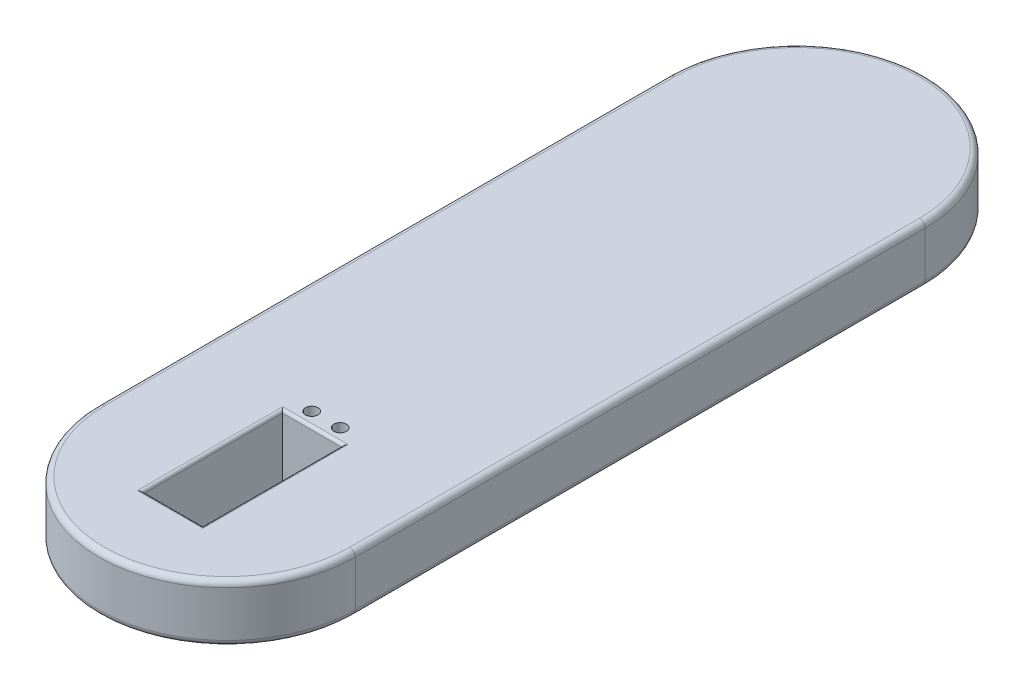
ISO-10303-21;
HEADER;
FILE_DESCRIPTION(('STEP AP214'),'2;1');
FILE_NAME('part.step','',(''),(''),'','','');
FILE_SCHEMA(('AUTOMOTIVE_DESIGN { 1 0 10303 214 1 1 1 1 }'));
ENDSEC;
DATA;
#1=APPLICATION_CONTEXT('core data for automotive mechanical design processes');
#2=APPLICATION_PROTOCOL_DEFINITION('international standard','automotive_design',2000,#1);
#3=PRODUCT_CONTEXT('',#1,'mechanical');
#4=PRODUCT('Part','Part','',(#3));
#5=PRODUCT_RELATED_PRODUCT_CATEGORY('part','',(#4));
#6=PRODUCT_DEFINITION_FORMATION('','',#4);
#7=PRODUCT_DEFINITION_CONTEXT('part definition',#1,'design');
#8=PRODUCT_DEFINITION('design','',#6,#7);
#9=PRODUCT_DEFINITION_SHAPE('','',#8);
#10=(LENGTH_UNIT() NAMED_UNIT(*) SI_UNIT(.MILLI.,.METRE.));
#11=(NAMED_UNIT(*) PLANE_ANGLE_UNIT() SI_UNIT($,.RADIAN.));
#12=(NAMED_UNIT(*) SI_UNIT($,.STERADIAN.) SOLID_ANGLE_UNIT());
#13=UNCERTAINTY_MEASURE_WITH_UNIT(LENGTH_MEASURE(1.E-05),#10,'distance_accuracy_value','');
#14=(GEOMETRIC_REPRESENTATION_CONTEXT(3) GLOBAL_UNCERTAINTY_ASSIGNED_CONTEXT((#13)) GLOBAL_UNIT_ASSIGNED_CONTEXT((#10,
#11,#12)) REPRESENTATION_CONTEXT('',''));
#15=CARTESIAN_POINT('',(0.,0.,0.));
#16=DIRECTION('',(0.,0.,1.));
#17=DIRECTION('',(1.,0.,0.));
#18=AXIS2_PLACEMENT_3D('',#15,#16,#17);
#19=CARTESIAN_POINT('',(-45.,-20.,0.));
#20=DIRECTION('',(0.,1.,0.));
#21=DIRECTION('',(0.,0.,1.));
#22=AXIS2_PLACEMENT_3D('',#19,#20,#21);
#23=CYLINDRICAL_SURFACE('',#22,45.);
#24=DIRECTION('',(0.,1.,0.));
#25=VECTOR('',#24,1.);
#26=CARTESIAN_POINT('',(-90.,-20.,0.));
#27=LINE('',#26,#25);
#28=CARTESIAN_POINT('',(-90.,-18.,0.));
#29=VERTEX_POINT('',#28);
#30=CARTESIAN_POINT('',(-90.,-2.,0.));
#31=VERTEX_POINT('',#30);
#32=EDGE_CURVE('E250',#29,#31,#27,.T.);
#33=ORIENTED_EDGE('',*,*,#32,.F.);
#34=CARTESIAN_POINT('',(-45.,-18.,0.));
#35=DIRECTION('',(0.,1.,0.));
#36=DIRECTION('',(0.,0.,1.));
#37=AXIS2_PLACEMENT_3D('',#34,#35,#36);
#38=CIRCLE('',#37,45.);
#39=CARTESIAN_POINT('',(0.,-18.,0.));
#40=VERTEX_POINT('',#39);
#41=EDGE_CURVE('E297',#29,#40,#38,.T.);
#42=ORIENTED_EDGE('',*,*,#41,.T.);
#43=DIRECTION('',(0.,1.,0.));
#44=VECTOR('',#43,1.);
#45=CARTESIAN_POINT('',(0.,-20.,0.));
#46=LINE('',#45,#44);
#47=CARTESIAN_POINT('',(0.,-2.,0.));
#48=VERTEX_POINT('',#47);
#49=EDGE_CURVE('E260',#40,#48,#46,.T.);
#50=ORIENTED_EDGE('',*,*,#49,.T.);
#51=CARTESIAN_POINT('',(-45.,-2.,0.));
#52=DIRECTION('',(0.,1.,0.));
#53=DIRECTION('',(0.,0.,1.));
#54=AXIS2_PLACEMENT_3D('',#51,#52,#53);
#55=CIRCLE('',#54,45.);
#56=EDGE_CURVE('E295',#48,#31,#55,.F.);
#57=ORIENTED_EDGE('',*,*,#56,.T.);
#58=EDGE_LOOP('',(#33,#42,#50,#57));
#59=FACE_BOUND('',#58,.T.);
#60=ADVANCED_FACE('F34',(#59),#23,.T.);
#61=CARTESIAN_POINT('',(-90.,-20.,0.));
#62=DIRECTION('',(-1.,0.,0.));
#63=DIRECTION('',(0.,0.,1.));
#64=AXIS2_PLACEMENT_3D('',#61,#62,#63);
#65=PLANE('',#64);
#66=DIRECTION('',(0.,1.,0.));
#67=VECTOR('',#66,1.);
#68=CARTESIAN_POINT('',(-90.,-20.,-200.));
#69=LINE('',#68,#67);
#70=CARTESIAN_POINT('',(-90.,-18.,-200.));
#71=VERTEX_POINT('',#70);
#72=CARTESIAN_POINT('',(-90.,-2.,-200.));
#73=VERTEX_POINT('',#72);
#74=EDGE_CURVE('E254',#71,#73,#69,.T.);
#75=ORIENTED_EDGE('',*,*,#74,.F.);
#76=DIRECTION('',(0.,0.,1.));
#77=VECTOR('',#76,1.);
#78=CARTESIAN_POINT('',(-90.,-18.,0.));
#79=LINE('',#78,#77);
#80=EDGE_CURVE('E289',#71,#29,#79,.T.);
#81=ORIENTED_EDGE('',*,*,#80,.T.);
#82=ORIENTED_EDGE('',*,*,#32,.T.);
#83=DIRECTION('',(0.,0.,1.));
#84=VECTOR('',#83,1.);
#85=CARTESIAN_POINT('',(-90.,-2.,0.));
#86=LINE('',#85,#84);
#87=EDGE_CURVE('E287',#31,#73,#86,.F.);
#88=ORIENTED_EDGE('',*,*,#87,.T.);
#89=EDGE_LOOP('',(#75,#81,#82,#88));
#90=FACE_BOUND('',#89,.T.);
#91=ADVANCED_FACE('F402',(#90),#65,.T.);
#92=CARTESIAN_POINT('',(-45.,-20.,-200.));
#93=DIRECTION('',(0.,1.,0.));
#94=DIRECTION('',(0.,0.,1.));
#95=AXIS2_PLACEMENT_3D('',#92,#93,#94);
#96=CYLINDRICAL_SURFACE('',#95,45.);
#97=DIRECTION('',(0.,1.,0.));
#98=VECTOR('',#97,1.);
#99=CARTESIAN_POINT('',(0.,-20.,-200.));
#100=LINE('',#99,#98);
#101=CARTESIAN_POINT('',(0.,-18.,-200.));
#102=VERTEX_POINT('',#101);
#103=CARTESIAN_POINT('',(0.,-2.,-200.));
#104=VERTEX_POINT('',#103);
#105=EDGE_CURVE('E257',#102,#104,#100,.T.);
#106=ORIENTED_EDGE('',*,*,#105,.F.);
#107=CARTESIAN_POINT('',(-45.,-18.,-200.));
#108=DIRECTION('',(0.,1.,0.));
#109=DIRECTION('',(0.,0.,1.));
#110=AXIS2_PLACEMENT_3D('',#107,#108,#109);
#111=CIRCLE('',#110,45.);
#112=EDGE_CURVE('E293',#102,#71,#111,.T.);
#113=ORIENTED_EDGE('',*,*,#112,.T.);
#114=ORIENTED_EDGE('',*,*,#74,.T.);
#115=CARTESIAN_POINT('',(-45.,-2.,-200.));
#116=DIRECTION('',(0.,1.,0.));
#117=DIRECTION('',(0.,0.,1.));
#118=AXIS2_PLACEMENT_3D('',#115,#116,#117);
#119=CIRCLE('',#118,45.);
#120=EDGE_CURVE('E291',#73,#104,#119,.F.);
#121=ORIENTED_EDGE('',*,*,#120,.T.);
#122=EDGE_LOOP('',(#106,#113,#114,#121));
#123=FACE_BOUND('',#122,.T.);
#124=ADVANCED_FACE('F408',(#123),#96,.T.);
#125=CARTESIAN_POINT('',(0.,-20.,0.));
#126=DIRECTION('',(1.,0.,0.));
#127=DIRECTION('',(0.,0.,-1.));
#128=AXIS2_PLACEMENT_3D('',#125,#126,#127);
#129=PLANE('',#128);
#130=ORIENTED_EDGE('',*,*,#49,.F.);
#131=DIRECTION('',(0.,0.,-1.));
#132=VECTOR('',#131,1.);
#133=CARTESIAN_POINT('',(0.,-18.,-200.));
#134=LINE('',#133,#132);
#135=EDGE_CURVE('E266',#40,#102,#134,.T.);
#136=ORIENTED_EDGE('',*,*,#135,.T.);
#137=ORIENTED_EDGE('',*,*,#105,.T.);
#138=DIRECTION('',(0.,0.,-1.));
#139=VECTOR('',#138,1.);
#140=CARTESIAN_POINT('',(0.,-2.,0.));
#141=LINE('',#140,#139);
#142=EDGE_CURVE('E253',#104,#48,#141,.F.);
#143=ORIENTED_EDGE('',*,*,#142,.T.);
#144=EDGE_LOOP('',(#130,#136,#137,#143));
#145=FACE_BOUND('',#144,.T.);
#146=ADVANCED_FACE('F414',(#145),#129,.T.);
#147=CARTESIAN_POINT('',(-45.,-20.,0.));
#148=DIRECTION('',(0.,1.,0.));
#149=DIRECTION('',(0.,0.,1.));
#150=AXIS2_PLACEMENT_3D('',#147,#148,#149);
#151=PLANE('',#150);
#152=DIRECTION('',(1.,0.,0.));
#153=VECTOR('',#152,1.);
#154=CARTESIAN_POINT('',(-45.,-20.,11.));
#155=LINE('',#154,#153);
#156=CARTESIAN_POINT('',(-60.5,-20.,11.));
#157=VERTEX_POINT('',#156);
#158=CARTESIAN_POINT('',(-55.5,-20.,11.));
#159=VERTEX_POINT('',#158);
#160=EDGE_CURVE('E240',#157,#159,#155,.T.);
#161=ORIENTED_EDGE('',*,*,#160,.T.);
#162=DIRECTION('',(0.,0.,1.));
#163=VECTOR('',#162,1.);
#164=CARTESIAN_POINT('',(-55.5,-20.,0.));
#165=LINE('',#164,#163);
#166=CARTESIAN_POINT('',(-55.5,-20.,19.));
#167=VERTEX_POINT('',#166);
#168=EDGE_CURVE('E201',#159,#167,#165,.T.);
#169=ORIENTED_EDGE('',*,*,#168,.T.);
#170=DIRECTION('',(1.,0.,0.));
#171=VECTOR('',#170,1.);
#172=CARTESIAN_POINT('',(-45.,-20.,19.));
#173=LINE('',#172,#171);
#174=CARTESIAN_POINT('',(-34.5,-20.,19.));
#175=VERTEX_POINT('',#174);
#176=EDGE_CURVE('E204',#167,#175,#173,.T.);
#177=ORIENTED_EDGE('',*,*,#176,.T.);
#178=DIRECTION('',(0.,0.,-1.));
#179=VECTOR('',#178,1.);
#180=CARTESIAN_POINT('',(-34.5,-20.,0.));
#181=LINE('',#180,#179);
#182=CARTESIAN_POINT('',(-34.5,-20.,11.));
#183=VERTEX_POINT('',#182);
#184=EDGE_CURVE('E196',#175,#183,#181,.T.);
#185=ORIENTED_EDGE('',*,*,#184,.T.);
#186=CARTESIAN_POINT('',(-29.5,-20.,11.));
#187=VERTEX_POINT('',#186);
#188=EDGE_CURVE('E239',#183,#187,#155,.T.);
#189=ORIENTED_EDGE('',*,*,#188,.T.);
#190=DIRECTION('',(0.,0.,-1.));
#191=VECTOR('',#190,1.);
#192=CARTESIAN_POINT('',(-29.5,-20.,0.));
#193=LINE('',#192,#191);
#194=CARTESIAN_POINT('',(-29.5,-20.,-41.));
#195=VERTEX_POINT('',#194);
#196=EDGE_CURVE('E223',#187,#195,#193,.T.);
#197=ORIENTED_EDGE('',*,*,#196,.T.);
#198=DIRECTION('',(-1.,0.,0.));
#199=VECTOR('',#198,1.);
#200=CARTESIAN_POINT('',(-45.,-20.,-41.));
#201=LINE('',#200,#199);
#202=CARTESIAN_POINT('',(-60.5,-20.,-41.));
#203=VERTEX_POINT('',#202);
#204=EDGE_CURVE('E233',#195,#203,#201,.T.);
#205=ORIENTED_EDGE('',*,*,#204,.T.);
#206=DIRECTION('',(0.,0.,1.));
#207=VECTOR('',#206,1.);
#208=CARTESIAN_POINT('',(-60.5,-20.,0.));
#209=LINE('',#208,#207);
#210=EDGE_CURVE('E236',#203,#157,#209,.T.);
#211=ORIENTED_EDGE('',*,*,#210,.T.);
#212=EDGE_LOOP('',(#161,#169,#177,#185,#189,#197,#205,#211));
#213=FACE_BOUND('',#212,.T.);
#214=CARTESIAN_POINT('',(-45.5,-20.,-200.));
#215=DIRECTION('',(0.,-1.,0.));
#216=DIRECTION('',(0.,0.,-1.));
#217=AXIS2_PLACEMENT_3D('',#214,#215,#216);
#218=CIRCLE('',#217,11.);
#219=CARTESIAN_POINT('',(-45.5,-20.,-211.));
#220=VERTEX_POINT('',#219);
#221=EDGE_CURVE('E243',#220,#220,#218,.T.);
#222=ORIENTED_EDGE('',*,*,#221,.F.);
#223=EDGE_LOOP('',(#222));
#224=FACE_BOUND('',#223,.T.);
#225=DIRECTION('',(0.,0.,1.));
#226=VECTOR('',#225,1.);
#227=CARTESIAN_POINT('',(-88.,-20.,-200.));
#228=LINE('',#227,#226);
#229=CARTESIAN_POINT('',(-88.,-20.,0.));
#230=VERTEX_POINT('',#229);
#231=CARTESIAN_POINT('',(-88.,-20.,-200.));
#232=VERTEX_POINT('',#231);
#233=EDGE_CURVE('E271',#230,#232,#228,.F.);
#234=ORIENTED_EDGE('',*,*,#233,.T.);
#235=CARTESIAN_POINT('',(-45.,-20.,-200.));
#236=DIRECTION('',(0.,1.,0.));
#237=DIRECTION('',(0.,0.,1.));
#238=AXIS2_PLACEMENT_3D('',#235,#236,#237);
#239=CIRCLE('',#238,43.);
#240=CARTESIAN_POINT('',(-2.,-20.,-200.));
#241=VERTEX_POINT('',#240);
#242=EDGE_CURVE('E276',#232,#241,#239,.F.);
#243=ORIENTED_EDGE('',*,*,#242,.T.);
#244=DIRECTION('',(0.,0.,-1.));
#245=VECTOR('',#244,1.);
#246=CARTESIAN_POINT('',(-2.,-20.,0.));
#247=LINE('',#246,#245);
#248=CARTESIAN_POINT('',(-2.,-20.,0.));
#249=VERTEX_POINT('',#248);
#250=EDGE_CURVE('E273',#241,#249,#247,.F.);
#251=ORIENTED_EDGE('',*,*,#250,.T.);
#252=CARTESIAN_POINT('',(-45.,-20.,0.));
#253=DIRECTION('',(0.,1.,0.));
#254=DIRECTION('',(0.,0.,1.));
#255=AXIS2_PLACEMENT_3D('',#252,#253,#254);
#256=CIRCLE('',#255,43.);
#257=EDGE_CURVE('E269',#249,#230,#256,.F.);
#258=ORIENTED_EDGE('',*,*,#257,.T.);
#259=EDGE_LOOP('',(#234,#243,#251,#258));
#260=FACE_BOUND('',#259,.T.);
#261=ADVANCED_FACE('F370',(#213,#224,#260),#151,.F.);
#262=CARTESIAN_POINT('',(-45.,0.,0.));
#263=DIRECTION('',(0.,1.,0.));
#264=DIRECTION('',(0.,0.,1.));
#265=AXIS2_PLACEMENT_3D('',#262,#263,#264);
#266=PLANE('',#265);
#267=CARTESIAN_POINT('',(-50.,0.,-34.7));
#268=DIRECTION('',(0.,1.,0.));
#269=DIRECTION('',(0.,0.,1.));
#270=AXIS2_PLACEMENT_3D('',#267,#268,#269);
#271=CIRCLE('',#270,2.2);
#272=CARTESIAN_POINT('',(-50.,0.,-32.5));
#273=VERTEX_POINT('',#272);
#274=EDGE_CURVE('E477',#273,#273,#271,.T.);
#275=ORIENTED_EDGE('',*,*,#274,.F.);
#276=EDGE_LOOP('',(#275));
#277=FACE_BOUND('',#276,.T.);
#278=CARTESIAN_POINT('',(-40.,0.,-34.7));
#279=DIRECTION('',(0.,1.,0.));
#280=DIRECTION('',(0.,0.,1.));
#281=AXIS2_PLACEMENT_3D('',#278,#279,#280);
#282=CIRCLE('',#281,2.2);
#283=CARTESIAN_POINT('',(-40.,0.,-32.5));
#284=VERTEX_POINT('',#283);
#285=EDGE_CURVE('E483',#284,#284,#282,.T.);
#286=ORIENTED_EDGE('',*,*,#285,.F.);
#287=EDGE_LOOP('',(#286));
#288=FACE_BOUND('',#287,.T.);
#289=DIRECTION('',(0.,0.,-1.));
#290=VECTOR('',#289,1.);
#291=CARTESIAN_POINT('',(-33.5,0.,19.));
#292=LINE('',#291,#290);
#293=CARTESIAN_POINT('',(-33.5,0.,-31.));
#294=VERTEX_POINT('',#293);
#295=CARTESIAN_POINT('',(-33.5,0.,20.));
#296=VERTEX_POINT('',#295);
#297=EDGE_CURVE('E330',#294,#296,#292,.F.);
#298=ORIENTED_EDGE('',*,*,#297,.T.);
#299=DIRECTION('',(1.,0.,0.));
#300=VECTOR('',#299,1.);
#301=CARTESIAN_POINT('',(-55.5,0.,20.));
#302=LINE('',#301,#300);
#303=CARTESIAN_POINT('',(-56.5,0.,20.));
#304=VERTEX_POINT('',#303);
#305=EDGE_CURVE('E332',#296,#304,#302,.F.);
#306=ORIENTED_EDGE('',*,*,#305,.T.);
#307=DIRECTION('',(0.,0.,1.));
#308=VECTOR('',#307,1.);
#309=CARTESIAN_POINT('',(-56.5,0.,-30.));
#310=LINE('',#309,#308);
#311=CARTESIAN_POINT('',(-56.5,0.,-31.));
#312=VERTEX_POINT('',#311);
#313=EDGE_CURVE('E326',#304,#312,#310,.F.);
#314=ORIENTED_EDGE('',*,*,#313,.T.);
#315=DIRECTION('',(-1.,0.,0.));
#316=VECTOR('',#315,1.);
#317=CARTESIAN_POINT('',(-34.5,0.,-31.));
#318=LINE('',#317,#316);
#319=EDGE_CURVE('E328',#312,#294,#318,.F.);
#320=ORIENTED_EDGE('',*,*,#319,.T.);
#321=EDGE_LOOP('',(#298,#306,#314,#320));
#322=FACE_BOUND('',#321,.T.);
#323=DIRECTION('',(0.,0.,-1.));
#324=VECTOR('',#323,1.);
#325=CARTESIAN_POINT('',(-2.,0.,0.));
#326=LINE('',#325,#324);
#327=CARTESIAN_POINT('',(-2.,0.,0.));
#328=VERTEX_POINT('',#327);
#329=CARTESIAN_POINT('',(-2.,0.,-200.));
#330=VERTEX_POINT('',#329);
#331=EDGE_CURVE('E282',#328,#330,#326,.T.);
#332=ORIENTED_EDGE('',*,*,#331,.T.);
#333=CARTESIAN_POINT('',(-45.,0.,-200.));
#334=DIRECTION('',(0.,1.,0.));
#335=DIRECTION('',(0.,0.,1.));
#336=AXIS2_PLACEMENT_3D('',#333,#334,#335);
#337=CIRCLE('',#336,43.);
#338=CARTESIAN_POINT('',(-88.,0.,-200.));
#339=VERTEX_POINT('',#338);
#340=EDGE_CURVE('E285',#330,#339,#337,.T.);
#341=ORIENTED_EDGE('',*,*,#340,.T.);
#342=DIRECTION('',(0.,0.,1.));
#343=VECTOR('',#342,1.);
#344=CARTESIAN_POINT('',(-88.,0.,0.));
#345=LINE('',#344,#343);
#346=CARTESIAN_POINT('',(-88.,0.,0.));
#347=VERTEX_POINT('',#346);
#348=EDGE_CURVE('E280',#339,#347,#345,.T.);
#349=ORIENTED_EDGE('',*,*,#348,.T.);
#350=CARTESIAN_POINT('',(-45.,0.,0.));
#351=DIRECTION('',(0.,1.,0.));
#352=DIRECTION('',(0.,0.,1.));
#353=AXIS2_PLACEMENT_3D('',#350,#351,#352);
#354=CIRCLE('',#353,43.);
#355=EDGE_CURVE('E278',#347,#328,#354,.T.);
#356=ORIENTED_EDGE('',*,*,#355,.T.);
#357=EDGE_LOOP('',(#332,#341,#349,#356));
#358=FACE_BOUND('',#357,.T.);
#359=ADVANCED_FACE('F356',(#277,#288,#322,#358),#266,.T.);
#360=CARTESIAN_POINT('',(-88.,-18.,0.));
#361=DIRECTION('',(0.,0.,-1.));
#362=DIRECTION('',(-1.,0.,0.));
#363=AXIS2_PLACEMENT_3D('',#360,#361,#362);
#364=CYLINDRICAL_SURFACE('',#363,2.);
#365=CARTESIAN_POINT('',(-88.,-18.,-200.));
#366=DIRECTION('',(0.,0.,-1.));
#367=DIRECTION('',(-1.,0.,0.));
#368=AXIS2_PLACEMENT_3D('',#365,#366,#367);
#369=CIRCLE('',#368,2.);
#370=EDGE_CURVE('E304',#232,#71,#369,.T.);
#371=ORIENTED_EDGE('',*,*,#370,.F.);
#372=ORIENTED_EDGE('',*,*,#233,.F.);
#373=CARTESIAN_POINT('',(-88.,-18.,0.));
#374=DIRECTION('',(0.,0.,1.));
#375=DIRECTION('',(1.,0.,0.));
#376=AXIS2_PLACEMENT_3D('',#373,#374,#375);
#377=CIRCLE('',#376,2.);
#378=EDGE_CURVE('E263',#29,#230,#377,.T.);
#379=ORIENTED_EDGE('',*,*,#378,.F.);
#380=ORIENTED_EDGE('',*,*,#80,.F.);
#381=EDGE_LOOP('',(#371,#372,#379,#380));
#382=FACE_BOUND('',#381,.T.);
#383=ADVANCED_FACE('F428',(#382),#364,.T.);
#384=CARTESIAN_POINT('',(-45.,-18.,0.));
#385=DIRECTION('',(0.,1.,0.));
#386=DIRECTION('',(0.,0.,1.));
#387=AXIS2_PLACEMENT_3D('',#384,#385,#386);
#388=TOROIDAL_SURFACE('',#387,43.,2.);
#389=ORIENTED_EDGE('',*,*,#378,.T.);
#390=ORIENTED_EDGE('',*,*,#257,.F.);
#391=CARTESIAN_POINT('',(-2.,-18.,0.));
#392=DIRECTION('',(0.,0.,-1.));
#393=DIRECTION('',(-1.,0.,0.));
#394=AXIS2_PLACEMENT_3D('',#391,#392,#393);
#395=CIRCLE('',#394,2.);
#396=EDGE_CURVE('E301',#40,#249,#395,.T.);
#397=ORIENTED_EDGE('',*,*,#396,.F.);
#398=ORIENTED_EDGE('',*,*,#41,.F.);
#399=EDGE_LOOP('',(#389,#390,#397,#398));
#400=FACE_BOUND('',#399,.T.);
#401=ADVANCED_FACE('F424',(#400),#388,.T.);
#402=CARTESIAN_POINT('',(-45.,-18.,-200.));
#403=DIRECTION('',(0.,1.,0.));
#404=DIRECTION('',(0.,0.,1.));
#405=AXIS2_PLACEMENT_3D('',#402,#403,#404);
#406=TOROIDAL_SURFACE('',#405,43.,2.);
#407=ORIENTED_EDGE('',*,*,#370,.T.);
#408=ORIENTED_EDGE('',*,*,#112,.F.);
#409=CARTESIAN_POINT('',(-2.,-18.,-200.));
#410=DIRECTION('',(0.,0.,1.));
#411=DIRECTION('',(1.,0.,0.));
#412=AXIS2_PLACEMENT_3D('',#409,#410,#411);
#413=CIRCLE('',#412,2.);
#414=EDGE_CURVE('E299',#241,#102,#413,.T.);
#415=ORIENTED_EDGE('',*,*,#414,.F.);
#416=ORIENTED_EDGE('',*,*,#242,.F.);
#417=EDGE_LOOP('',(#407,#408,#415,#416));
#418=FACE_BOUND('',#417,.T.);
#419=ADVANCED_FACE('F420',(#418),#406,.T.);
#420=CARTESIAN_POINT('',(-2.,-18.,0.));
#421=DIRECTION('',(0.,0.,1.));
#422=DIRECTION('',(1.,0.,0.));
#423=AXIS2_PLACEMENT_3D('',#420,#421,#422);
#424=CYLINDRICAL_SURFACE('',#423,2.);
#425=ORIENTED_EDGE('',*,*,#396,.T.);
#426=ORIENTED_EDGE('',*,*,#250,.F.);
#427=ORIENTED_EDGE('',*,*,#414,.T.);
#428=ORIENTED_EDGE('',*,*,#135,.F.);
#429=EDGE_LOOP('',(#425,#426,#427,#428));
#430=FACE_BOUND('',#429,.T.);
#431=ADVANCED_FACE('F416',(#430),#424,.T.);
#432=CARTESIAN_POINT('',(-88.,-2.,0.));
#433=DIRECTION('',(0.,0.,1.));
#434=DIRECTION('',(1.,0.,0.));
#435=AXIS2_PLACEMENT_3D('',#432,#433,#434);
#436=CYLINDRICAL_SURFACE('',#435,2.);
#437=CARTESIAN_POINT('',(-88.,-2.,-200.));
#438=DIRECTION('',(0.,0.,-1.));
#439=DIRECTION('',(-1.,0.,0.));
#440=AXIS2_PLACEMENT_3D('',#437,#438,#439);
#441=CIRCLE('',#440,2.);
#442=EDGE_CURVE('E312',#73,#339,#441,.T.);
#443=ORIENTED_EDGE('',*,*,#442,.F.);
#444=ORIENTED_EDGE('',*,*,#87,.F.);
#445=CARTESIAN_POINT('',(-88.,-2.,0.));
#446=DIRECTION('',(0.,0.,1.));
#447=DIRECTION('',(1.,0.,0.));
#448=AXIS2_PLACEMENT_3D('',#445,#446,#447);
#449=CIRCLE('',#448,2.);
#450=EDGE_CURVE('E302',#347,#31,#449,.T.);
#451=ORIENTED_EDGE('',*,*,#450,.F.);
#452=ORIENTED_EDGE('',*,*,#348,.F.);
#453=EDGE_LOOP('',(#443,#444,#451,#452));
#454=FACE_BOUND('',#453,.T.);
#455=ADVANCED_FACE('F419',(#454),#436,.T.);
#456=CARTESIAN_POINT('',(-45.,-2.,0.));
#457=DIRECTION('',(0.,1.,0.));
#458=DIRECTION('',(0.,0.,1.));
#459=AXIS2_PLACEMENT_3D('',#456,#457,#458);
#460=TOROIDAL_SURFACE('',#459,43.,2.);
#461=ORIENTED_EDGE('',*,*,#450,.T.);
#462=ORIENTED_EDGE('',*,*,#56,.F.);
#463=CARTESIAN_POINT('',(-2.,-2.,0.));
#464=DIRECTION('',(0.,0.,-1.));
#465=DIRECTION('',(-1.,0.,0.));
#466=AXIS2_PLACEMENT_3D('',#463,#464,#465);
#467=CIRCLE('',#466,2.);
#468=EDGE_CURVE('E310',#328,#48,#467,.T.);
#469=ORIENTED_EDGE('',*,*,#468,.F.);
#470=ORIENTED_EDGE('',*,*,#355,.F.);
#471=EDGE_LOOP('',(#461,#462,#469,#470));
#472=FACE_BOUND('',#471,.T.);
#473=ADVANCED_FACE('F441',(#472),#460,.T.);
#474=CARTESIAN_POINT('',(-45.,-2.,-200.));
#475=DIRECTION('',(0.,1.,0.));
#476=DIRECTION('',(0.,0.,1.));
#477=AXIS2_PLACEMENT_3D('',#474,#475,#476);
#478=TOROIDAL_SURFACE('',#477,43.,2.);
#479=ORIENTED_EDGE('',*,*,#442,.T.);
#480=ORIENTED_EDGE('',*,*,#340,.F.);
#481=CARTESIAN_POINT('',(-2.,-2.,-200.));
#482=DIRECTION('',(0.,0.,1.));
#483=DIRECTION('',(1.,0.,0.));
#484=AXIS2_PLACEMENT_3D('',#481,#482,#483);
#485=CIRCLE('',#484,2.);
#486=EDGE_CURVE('E247',#104,#330,#485,.T.);
#487=ORIENTED_EDGE('',*,*,#486,.F.);
#488=ORIENTED_EDGE('',*,*,#120,.F.);
#489=EDGE_LOOP('',(#479,#480,#487,#488));
#490=FACE_BOUND('',#489,.T.);
#491=ADVANCED_FACE('F437',(#490),#478,.T.);
#492=CARTESIAN_POINT('',(-2.,-2.,0.));
#493=DIRECTION('',(0.,0.,-1.));
#494=DIRECTION('',(-1.,0.,0.));
#495=AXIS2_PLACEMENT_3D('',#492,#493,#494);
#496=CYLINDRICAL_SURFACE('',#495,2.);
#497=ORIENTED_EDGE('',*,*,#468,.T.);
#498=ORIENTED_EDGE('',*,*,#142,.F.);
#499=ORIENTED_EDGE('',*,*,#486,.T.);
#500=ORIENTED_EDGE('',*,*,#331,.F.);
#501=EDGE_LOOP('',(#497,#498,#499,#500));
#502=FACE_BOUND('',#501,.T.);
#503=ADVANCED_FACE('F433',(#502),#496,.T.);
#504=CARTESIAN_POINT('',(-45.5,-13.65,-200.));
#505=DIRECTION('',(0.,-1.,0.));
#506=DIRECTION('',(0.,0.,-1.));
#507=AXIS2_PLACEMENT_3D('',#504,#505,#506);
#508=CYLINDRICAL_SURFACE('',#507,11.);
#509=CARTESIAN_POINT('',(-45.5,-13.65,-200.));
#510=DIRECTION('',(0.,-1.,0.));
#511=DIRECTION('',(0.,0.,-1.));
#512=AXIS2_PLACEMENT_3D('',#509,#510,#511);
#513=CIRCLE('',#512,11.);
#514=CARTESIAN_POINT('',(-45.5,-13.65,-211.));
#515=VERTEX_POINT('',#514);
#516=EDGE_CURVE('E244',#515,#515,#513,.T.);
#517=ORIENTED_EDGE('',*,*,#516,.F.);
#518=EDGE_LOOP('',(#517));
#519=FACE_BOUND('',#518,.T.);
#520=ORIENTED_EDGE('',*,*,#221,.T.);
#521=EDGE_LOOP('',(#520));
#522=FACE_BOUND('',#521,.T.);
#523=ADVANCED_FACE('F436',(#519,#522),#508,.F.);
#524=CARTESIAN_POINT('',(-45.5,-13.65,-200.));
#525=DIRECTION('',(0.,-1.,0.));
#526=DIRECTION('',(0.,0.,-1.));
#527=AXIS2_PLACEMENT_3D('',#524,#525,#526);
#528=PLANE('',#527);
#529=ORIENTED_EDGE('',*,*,#516,.T.);
#530=EDGE_LOOP('',(#529));
#531=FACE_BOUND('',#530,.T.);
#532=ADVANCED_FACE('F551',(#531),#528,.T.);
#533=CARTESIAN_POINT('',(-29.5,-36.,11.));
#534=DIRECTION('',(0.,0.,1.));
#535=DIRECTION('',(1.,0.,0.));
#536=AXIS2_PLACEMENT_3D('',#533,#534,#535);
#537=PLANE('',#536);
#538=DIRECTION('',(0.,-1.,0.));
#539=VECTOR('',#538,1.);
#540=CARTESIAN_POINT('',(-55.5,-36.,11.));
#541=LINE('',#540,#539);
#542=CARTESIAN_POINT('',(-55.5,-26.,11.));
#543=VERTEX_POINT('',#542);
#544=EDGE_CURVE('E320',#159,#543,#541,.T.);
#545=ORIENTED_EDGE('',*,*,#544,.F.);
#546=ORIENTED_EDGE('',*,*,#160,.F.);
#547=DIRECTION('',(0.,1.,0.));
#548=VECTOR('',#547,1.);
#549=CARTESIAN_POINT('',(-60.5,-36.,11.));
#550=LINE('',#549,#548);
#551=CARTESIAN_POINT('',(-60.5,-36.,11.));
#552=VERTEX_POINT('',#551);
#553=EDGE_CURVE('E220',#552,#157,#550,.T.);
#554=ORIENTED_EDGE('',*,*,#553,.F.);
#555=DIRECTION('',(1.,0.,0.));
#556=VECTOR('',#555,1.);
#557=CARTESIAN_POINT('',(-29.5,-36.,11.));
#558=LINE('',#557,#556);
#559=CARTESIAN_POINT('',(-29.5,-36.,11.));
#560=VERTEX_POINT('',#559);
#561=EDGE_CURVE('E207',#552,#560,#558,.T.);
#562=ORIENTED_EDGE('',*,*,#561,.T.);
#563=DIRECTION('',(0.,1.,0.));
#564=VECTOR('',#563,1.);
#565=CARTESIAN_POINT('',(-29.5,-36.,11.));
#566=LINE('',#565,#564);
#567=EDGE_CURVE('E219',#560,#187,#566,.T.);
#568=ORIENTED_EDGE('',*,*,#567,.T.);
#569=ORIENTED_EDGE('',*,*,#188,.F.);
#570=DIRECTION('',(0.,1.,0.));
#571=VECTOR('',#570,1.);
#572=CARTESIAN_POINT('',(-34.5,-36.,11.));
#573=LINE('',#572,#571);
#574=CARTESIAN_POINT('',(-34.5,-26.,11.));
#575=VERTEX_POINT('',#574);
#576=EDGE_CURVE('E318',#575,#183,#573,.T.);
#577=ORIENTED_EDGE('',*,*,#576,.F.);
#578=DIRECTION('',(1.,0.,0.));
#579=VECTOR('',#578,1.);
#580=CARTESIAN_POINT('',(-29.5,-26.,11.));
#581=LINE('',#580,#579);
#582=EDGE_CURVE('E179',#543,#575,#581,.T.);
#583=ORIENTED_EDGE('',*,*,#582,.F.);
#584=EDGE_LOOP('',(#545,#546,#554,#562,#568,#569,#577,#583));
#585=FACE_BOUND('',#584,.T.);
#586=ADVANCED_FACE('F375',(#585),#537,.T.);
#587=CARTESIAN_POINT('',(-60.5,-36.,11.));
#588=DIRECTION('',(-1.,0.,0.));
#589=DIRECTION('',(0.,0.,1.));
#590=AXIS2_PLACEMENT_3D('',#587,#588,#589);
#591=PLANE('',#590);
#592=ORIENTED_EDGE('',*,*,#210,.F.);
#593=DIRECTION('',(0.,1.,0.));
#594=VECTOR('',#593,1.);
#595=CARTESIAN_POINT('',(-60.5,-36.,-41.));
#596=LINE('',#595,#594);
#597=CARTESIAN_POINT('',(-60.5,-36.,-41.));
#598=VERTEX_POINT('',#597);
#599=EDGE_CURVE('E224',#598,#203,#596,.T.);
#600=ORIENTED_EDGE('',*,*,#599,.F.);
#601=DIRECTION('',(0.,0.,1.));
#602=VECTOR('',#601,1.);
#603=CARTESIAN_POINT('',(-60.5,-36.,11.));
#604=LINE('',#603,#602);
#605=EDGE_CURVE('E216',#598,#552,#604,.T.);
#606=ORIENTED_EDGE('',*,*,#605,.T.);
#607=ORIENTED_EDGE('',*,*,#553,.T.);
#608=EDGE_LOOP('',(#592,#600,#606,#607));
#609=FACE_BOUND('',#608,.T.);
#610=ADVANCED_FACE('F388',(#609),#591,.T.);
#611=CARTESIAN_POINT('',(-60.5,-36.,-41.));
#612=DIRECTION('',(0.,0.,-1.));
#613=DIRECTION('',(-1.,0.,0.));
#614=AXIS2_PLACEMENT_3D('',#611,#612,#613);
#615=PLANE('',#614);
#616=ORIENTED_EDGE('',*,*,#204,.F.);
#617=DIRECTION('',(0.,1.,0.));
#618=VECTOR('',#617,1.);
#619=CARTESIAN_POINT('',(-29.5,-36.,-41.));
#620=LINE('',#619,#618);
#621=CARTESIAN_POINT('',(-29.5,-36.,-41.));
#622=VERTEX_POINT('',#621);
#623=EDGE_CURVE('E227',#622,#195,#620,.T.);
#624=ORIENTED_EDGE('',*,*,#623,.F.);
#625=DIRECTION('',(-1.,0.,0.));
#626=VECTOR('',#625,1.);
#627=CARTESIAN_POINT('',(-60.5,-36.,-41.));
#628=LINE('',#627,#626);
#629=EDGE_CURVE('E213',#622,#598,#628,.T.);
#630=ORIENTED_EDGE('',*,*,#629,.T.);
#631=ORIENTED_EDGE('',*,*,#599,.T.);
#632=EDGE_LOOP('',(#616,#624,#630,#631));
#633=FACE_BOUND('',#632,.T.);
#634=ADVANCED_FACE('F386',(#633),#615,.T.);
#635=CARTESIAN_POINT('',(-29.5,-36.,-41.));
#636=DIRECTION('',(1.,0.,0.));
#637=DIRECTION('',(0.,0.,-1.));
#638=AXIS2_PLACEMENT_3D('',#635,#636,#637);
#639=PLANE('',#638);
#640=ORIENTED_EDGE('',*,*,#196,.F.);
#641=ORIENTED_EDGE('',*,*,#567,.F.);
#642=DIRECTION('',(0.,0.,-1.));
#643=VECTOR('',#642,1.);
#644=CARTESIAN_POINT('',(-29.5,-36.,-41.));
#645=LINE('',#644,#643);
#646=EDGE_CURVE('E210',#560,#622,#645,.T.);
#647=ORIENTED_EDGE('',*,*,#646,.T.);
#648=ORIENTED_EDGE('',*,*,#623,.T.);
#649=EDGE_LOOP('',(#640,#641,#647,#648));
#650=FACE_BOUND('',#649,.T.);
#651=ADVANCED_FACE('F379',(#650),#639,.T.);
#652=CARTESIAN_POINT('',(0.,-36.,0.));
#653=DIRECTION('',(0.,-1.,0.));
#654=DIRECTION('',(0.,0.,-1.));
#655=AXIS2_PLACEMENT_3D('',#652,#653,#654);
#656=PLANE('',#655);
#657=CARTESIAN_POINT('',(-50.,-36.,-34.7));
#658=DIRECTION('',(0.,1.,0.));
#659=DIRECTION('',(0.,0.,1.));
#660=AXIS2_PLACEMENT_3D('',#657,#658,#659);
#661=CIRCLE('',#660,2.2);
#662=CARTESIAN_POINT('',(-50.,-36.,-32.5));
#663=VERTEX_POINT('',#662);
#664=EDGE_CURVE('E340',#663,#663,#661,.T.);
#665=ORIENTED_EDGE('',*,*,#664,.T.);
#666=EDGE_LOOP('',(#665));
#667=FACE_BOUND('',#666,.T.);
#668=CARTESIAN_POINT('',(-40.,-36.,-34.7));
#669=DIRECTION('',(0.,1.,0.));
#670=DIRECTION('',(0.,0.,1.));
#671=AXIS2_PLACEMENT_3D('',#668,#669,#670);
#672=CIRCLE('',#671,2.2);
#673=CARTESIAN_POINT('',(-40.,-36.,-32.5));
#674=VERTEX_POINT('',#673);
#675=EDGE_CURVE('E479',#674,#674,#672,.T.);
#676=ORIENTED_EDGE('',*,*,#675,.T.);
#677=EDGE_LOOP('',(#676));
#678=FACE_BOUND('',#677,.T.);
#679=ORIENTED_EDGE('',*,*,#561,.F.);
#680=ORIENTED_EDGE('',*,*,#605,.F.);
#681=ORIENTED_EDGE('',*,*,#629,.F.);
#682=ORIENTED_EDGE('',*,*,#646,.F.);
#683=EDGE_LOOP('',(#679,#680,#681,#682));
#684=FACE_BOUND('',#683,.T.);
#685=ADVANCED_FACE('F382',(#667,#678,#684),#656,.T.);
#686=CARTESIAN_POINT('',(-34.5,-26.,19.));
#687=DIRECTION('',(0.,0.,1.));
#688=DIRECTION('',(1.,0.,0.));
#689=AXIS2_PLACEMENT_3D('',#686,#687,#688);
#690=PLANE('',#689);
#691=DIRECTION('',(0.,1.,0.));
#692=VECTOR('',#691,1.);
#693=CARTESIAN_POINT('',(-55.5,-26.,19.));
#694=LINE('',#693,#692);
#695=CARTESIAN_POINT('',(-55.5,-1.00000000000001,19.));
#696=VERTEX_POINT('',#695);
#697=EDGE_CURVE('E193',#167,#696,#694,.T.);
#698=ORIENTED_EDGE('',*,*,#697,.T.);
#699=DIRECTION('',(1.,0.,0.));
#700=VECTOR('',#699,1.);
#701=CARTESIAN_POINT('',(-34.5,-1.,19.));
#702=LINE('',#701,#700);
#703=CARTESIAN_POINT('',(-34.5,-1.00000000000001,19.));
#704=VERTEX_POINT('',#703);
#705=EDGE_CURVE('E323',#696,#704,#702,.T.);
#706=ORIENTED_EDGE('',*,*,#705,.T.);
#707=DIRECTION('',(0.,1.,0.));
#708=VECTOR('',#707,1.);
#709=CARTESIAN_POINT('',(-34.5,-26.,19.));
#710=LINE('',#709,#708);
#711=EDGE_CURVE('E185',#175,#704,#710,.T.);
#712=ORIENTED_EDGE('',*,*,#711,.F.);
#713=ORIENTED_EDGE('',*,*,#176,.F.);
#714=EDGE_LOOP('',(#698,#706,#712,#713));
#715=FACE_BOUND('',#714,.T.);
#716=ADVANCED_FACE('F366',(#715),#690,.F.);
#717=CARTESIAN_POINT('',(-55.5,-26.,19.));
#718=DIRECTION('',(-1.,0.,0.));
#719=DIRECTION('',(0.,0.,1.));
#720=AXIS2_PLACEMENT_3D('',#717,#718,#719);
#721=PLANE('',#720);
#722=DIRECTION('',(0.,1.,0.));
#723=VECTOR('',#722,1.);
#724=CARTESIAN_POINT('',(-55.5,-26.,-30.));
#725=LINE('',#724,#723);
#726=CARTESIAN_POINT('',(-55.5,-26.,-30.));
#727=VERTEX_POINT('',#726);
#728=CARTESIAN_POINT('',(-55.5,-1.00000000000001,-30.));
#729=VERTEX_POINT('',#728);
#730=EDGE_CURVE('E184',#727,#729,#725,.T.);
#731=ORIENTED_EDGE('',*,*,#730,.T.);
#732=DIRECTION('',(0.,0.,1.));
#733=VECTOR('',#732,1.);
#734=CARTESIAN_POINT('',(-55.5,-1.,19.));
#735=LINE('',#734,#733);
#736=EDGE_CURVE('E11',#729,#696,#735,.T.);
#737=ORIENTED_EDGE('',*,*,#736,.T.);
#738=ORIENTED_EDGE('',*,*,#697,.F.);
#739=ORIENTED_EDGE('',*,*,#168,.F.);
#740=ORIENTED_EDGE('',*,*,#544,.T.);
#741=DIRECTION('',(0.,0.,1.));
#742=VECTOR('',#741,1.);
#743=CARTESIAN_POINT('',(-55.5,-26.,19.));
#744=LINE('',#743,#742);
#745=EDGE_CURVE('E188',#727,#543,#744,.T.);
#746=ORIENTED_EDGE('',*,*,#745,.F.);
#747=EDGE_LOOP('',(#731,#737,#738,#739,#740,#746));
#748=FACE_BOUND('',#747,.T.);
#749=ADVANCED_FACE('F390',(#748),#721,.F.);
#750=CARTESIAN_POINT('',(-34.5,-26.,-30.));
#751=DIRECTION('',(1.,0.,0.));
#752=DIRECTION('',(0.,0.,-1.));
#753=AXIS2_PLACEMENT_3D('',#750,#751,#752);
#754=PLANE('',#753);
#755=ORIENTED_EDGE('',*,*,#711,.T.);
#756=DIRECTION('',(0.,0.,-1.));
#757=VECTOR('',#756,1.);
#758=CARTESIAN_POINT('',(-34.5,-1.,-30.));
#759=LINE('',#758,#757);
#760=CARTESIAN_POINT('',(-34.5,-1.00000000000001,-30.));
#761=VERTEX_POINT('',#760);
#762=EDGE_CURVE('E58',#704,#761,#759,.T.);
#763=ORIENTED_EDGE('',*,*,#762,.T.);
#764=DIRECTION('',(0.,1.,0.));
#765=VECTOR('',#764,1.);
#766=CARTESIAN_POINT('',(-34.5,-26.,-30.));
#767=LINE('',#766,#765);
#768=CARTESIAN_POINT('',(-34.5,-26.,-30.));
#769=VERTEX_POINT('',#768);
#770=EDGE_CURVE('E182',#769,#761,#767,.T.);
#771=ORIENTED_EDGE('',*,*,#770,.F.);
#772=DIRECTION('',(0.,0.,-1.));
#773=VECTOR('',#772,1.);
#774=CARTESIAN_POINT('',(-34.5,-26.,-30.));
#775=LINE('',#774,#773);
#776=EDGE_CURVE('E173',#575,#769,#775,.T.);
#777=ORIENTED_EDGE('',*,*,#776,.F.);
#778=ORIENTED_EDGE('',*,*,#576,.T.);
#779=ORIENTED_EDGE('',*,*,#184,.F.);
#780=EDGE_LOOP('',(#755,#763,#771,#777,#778,#779));
#781=FACE_BOUND('',#780,.T.);
#782=ADVANCED_FACE('F183',(#781),#754,.F.);
#783=CARTESIAN_POINT('',(-55.5,-26.,-30.));
#784=DIRECTION('',(0.,0.,-1.));
#785=DIRECTION('',(-1.,0.,0.));
#786=AXIS2_PLACEMENT_3D('',#783,#784,#785);
#787=PLANE('',#786);
#788=ORIENTED_EDGE('',*,*,#770,.T.);
#789=DIRECTION('',(-1.,0.,0.));
#790=VECTOR('',#789,1.);
#791=CARTESIAN_POINT('',(-55.5,-1.,-30.));
#792=LINE('',#791,#790);
#793=EDGE_CURVE('E43',#761,#729,#792,.T.);
#794=ORIENTED_EDGE('',*,*,#793,.T.);
#795=ORIENTED_EDGE('',*,*,#730,.F.);
#796=DIRECTION('',(-1.,0.,0.));
#797=VECTOR('',#796,1.);
#798=CARTESIAN_POINT('',(-55.5,-26.,-30.));
#799=LINE('',#798,#797);
#800=EDGE_CURVE('E176',#769,#727,#799,.T.);
#801=ORIENTED_EDGE('',*,*,#800,.F.);
#802=EDGE_LOOP('',(#788,#794,#795,#801));
#803=FACE_BOUND('',#802,.T.);
#804=ADVANCED_FACE('F187',(#803),#787,.F.);
#805=CARTESIAN_POINT('',(0.,-26.,0.));
#806=DIRECTION('',(0.,-1.,0.));
#807=DIRECTION('',(0.,0.,-1.));
#808=AXIS2_PLACEMENT_3D('',#805,#806,#807);
#809=PLANE('',#808);
#810=ORIENTED_EDGE('',*,*,#582,.T.);
#811=ORIENTED_EDGE('',*,*,#776,.T.);
#812=ORIENTED_EDGE('',*,*,#800,.T.);
#813=ORIENTED_EDGE('',*,*,#745,.T.);
#814=EDGE_LOOP('',(#810,#811,#812,#813));
#815=FACE_BOUND('',#814,.T.);
#816=ADVANCED_FACE('F174',(#815),#809,.F.);
#817=CARTESIAN_POINT('',(-55.5,-1.,-31.));
#818=DIRECTION('',(1.,0.,0.));
#819=DIRECTION('',(0.,0.,-1.));
#820=AXIS2_PLACEMENT_3D('',#817,#818,#819);
#821=CYLINDRICAL_SURFACE('',#820,1.);
#822=CARTESIAN_POINT('',(-33.5,-1.,-31.));
#823=DIRECTION('',(0.707106781186547,0.,0.707106781186547));
#824=DIRECTION('',(-0.707106781186547,0.,0.707106781186547));
#825=AXIS2_PLACEMENT_3D('',#822,#823,#824);
#826=ELLIPSE('',#825,1.41421356237309,1.);
#827=EDGE_CURVE('E341',#294,#761,#826,.T.);
#828=ORIENTED_EDGE('',*,*,#827,.F.);
#829=ORIENTED_EDGE('',*,*,#319,.F.);
#830=CARTESIAN_POINT('',(-56.5,-1.,-31.));
#831=DIRECTION('',(0.707106781186547,0.,-0.707106781186547));
#832=DIRECTION('',(0.707106781186547,0.,0.707106781186547));
#833=AXIS2_PLACEMENT_3D('',#830,#831,#832);
#834=ELLIPSE('',#833,1.41421356237309,1.);
#835=EDGE_CURVE('E38',#729,#312,#834,.F.);
#836=ORIENTED_EDGE('',*,*,#835,.F.);
#837=ORIENTED_EDGE('',*,*,#793,.F.);
#838=EDGE_LOOP('',(#828,#829,#836,#837));
#839=FACE_BOUND('',#838,.T.);
#840=ADVANCED_FACE('F36',(#839),#821,.T.);
#841=CARTESIAN_POINT('',(-56.5,-1.,19.));
#842=DIRECTION('',(0.,0.,-1.));
#843=DIRECTION('',(-1.,0.,0.));
#844=AXIS2_PLACEMENT_3D('',#841,#842,#843);
#845=CYLINDRICAL_SURFACE('',#844,1.);
#846=ORIENTED_EDGE('',*,*,#835,.T.);
#847=ORIENTED_EDGE('',*,*,#313,.F.);
#848=CARTESIAN_POINT('',(-56.5,-1.,20.));
#849=DIRECTION('',(-0.707106781186547,0.,-0.707106781186547));
#850=DIRECTION('',(-0.707106781186547,0.,0.707106781186547));
#851=AXIS2_PLACEMENT_3D('',#848,#849,#850);
#852=ELLIPSE('',#851,1.41421356237309,1.);
#853=EDGE_CURVE('E339',#696,#304,#852,.F.);
#854=ORIENTED_EDGE('',*,*,#853,.F.);
#855=ORIENTED_EDGE('',*,*,#736,.F.);
#856=EDGE_LOOP('',(#846,#847,#854,#855));
#857=FACE_BOUND('',#856,.T.);
#858=ADVANCED_FACE('F351',(#857),#845,.T.);
#859=CARTESIAN_POINT('',(-33.5,-1.,-30.));
#860=DIRECTION('',(0.,0.,1.));
#861=DIRECTION('',(1.,0.,0.));
#862=AXIS2_PLACEMENT_3D('',#859,#860,#861);
#863=CYLINDRICAL_SURFACE('',#862,1.);
#864=ORIENTED_EDGE('',*,*,#827,.T.);
#865=ORIENTED_EDGE('',*,*,#762,.F.);
#866=CARTESIAN_POINT('',(-33.5,-1.,20.));
#867=DIRECTION('',(-0.707106781186547,0.,0.707106781186547));
#868=DIRECTION('',(-0.707106781186547,0.,-0.707106781186547));
#869=AXIS2_PLACEMENT_3D('',#866,#867,#868);
#870=ELLIPSE('',#869,1.41421356237309,1.);
#871=EDGE_CURVE('E337',#296,#704,#870,.T.);
#872=ORIENTED_EDGE('',*,*,#871,.F.);
#873=ORIENTED_EDGE('',*,*,#297,.F.);
#874=EDGE_LOOP('',(#864,#865,#872,#873));
#875=FACE_BOUND('',#874,.T.);
#876=ADVANCED_FACE('F363',(#875),#863,.T.);
#877=CARTESIAN_POINT('',(-34.5,-1.,20.));
#878=DIRECTION('',(-1.,0.,0.));
#879=DIRECTION('',(0.,0.,1.));
#880=AXIS2_PLACEMENT_3D('',#877,#878,#879);
#881=CYLINDRICAL_SURFACE('',#880,1.);
#882=ORIENTED_EDGE('',*,*,#853,.T.);
#883=ORIENTED_EDGE('',*,*,#305,.F.);
#884=ORIENTED_EDGE('',*,*,#871,.T.);
#885=ORIENTED_EDGE('',*,*,#705,.F.);
#886=EDGE_LOOP('',(#882,#883,#884,#885));
#887=FACE_BOUND('',#886,.T.);
#888=ADVANCED_FACE('F361',(#887),#881,.T.);
#889=CARTESIAN_POINT('',(-40.,-36.,-34.7));
#890=DIRECTION('',(0.,1.,0.));
#891=DIRECTION('',(0.,0.,1.));
#892=AXIS2_PLACEMENT_3D('',#889,#890,#891);
#893=CYLINDRICAL_SURFACE('',#892,2.2);
#894=ORIENTED_EDGE('',*,*,#675,.F.);
#895=EDGE_LOOP('',(#894));
#896=FACE_BOUND('',#895,.T.);
#897=ORIENTED_EDGE('',*,*,#285,.T.);
#898=EDGE_LOOP('',(#897));
#899=FACE_BOUND('',#898,.T.);
#900=ADVANCED_FACE('F451',(#896,#899),#893,.F.);
#901=CARTESIAN_POINT('',(-50.,-36.,-34.7));
#902=DIRECTION('',(0.,1.,0.));
#903=DIRECTION('',(0.,0.,1.));
#904=AXIS2_PLACEMENT_3D('',#901,#902,#903);
#905=CYLINDRICAL_SURFACE('',#904,2.2);
#906=ORIENTED_EDGE('',*,*,#664,.F.);
#907=EDGE_LOOP('',(#906));
#908=FACE_BOUND('',#907,.T.);
#909=ORIENTED_EDGE('',*,*,#274,.T.);
#910=EDGE_LOOP('',(#909));
#911=FACE_BOUND('',#910,.T.);
#912=ADVANCED_FACE('F466',(#908,#911),#905,.F.);
#913=CLOSED_SHELL('',(#60,#91,#124,#146,#261,#359,#383,#401,#419,#431,#455,#473,#491,#503,#523,
#532,#586,#610,#634,#651,#685,#716,#749,#782,#804,#816,#840,#858,#876,#888,#900,#912));
#914=MANIFOLD_SOLID_BREP('B2',#913);
#915=ADVANCED_BREP_SHAPE_REPRESENTATION('',(#18,#914),#14);
#916=SHAPE_DEFINITION_REPRESENTATION(#9,#915);
ENDSEC;
END-ISO-10303-21;
